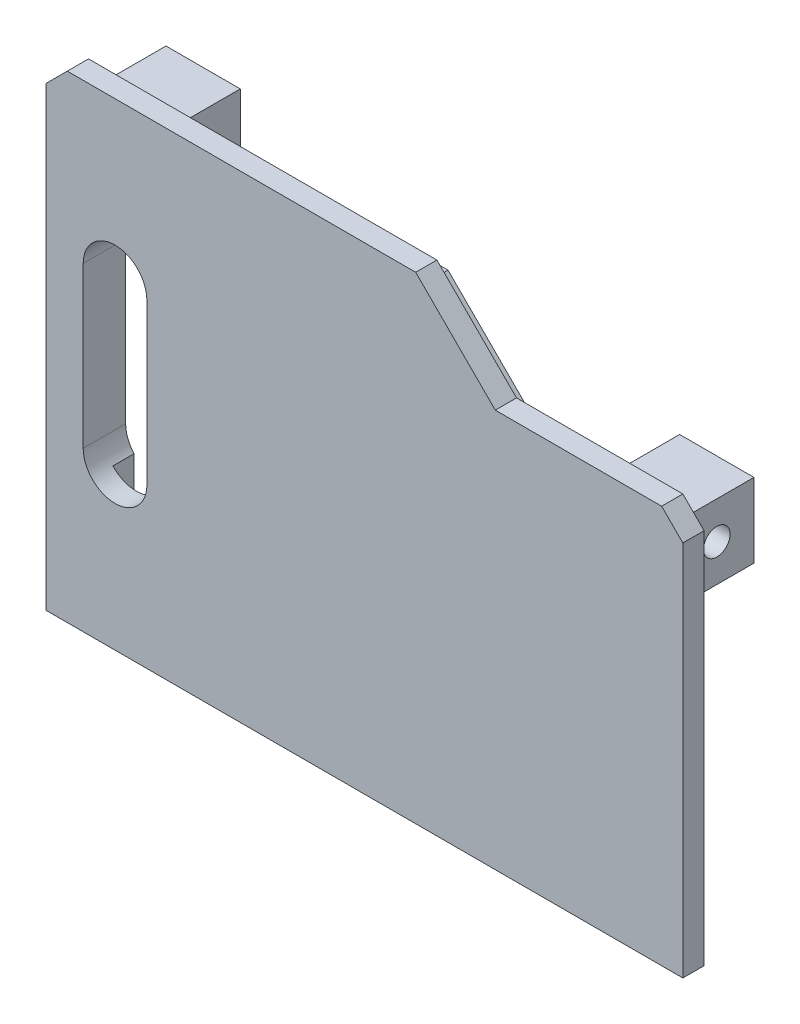
ISO-10303-21;
HEADER;
FILE_DESCRIPTION(('STEP AP214'),'2;1');
FILE_NAME('part.step','',(''),(''),'','','');
FILE_SCHEMA(('AUTOMOTIVE_DESIGN { 1 0 10303 214 1 1 1 1 }'));
ENDSEC;
DATA;
#1=APPLICATION_CONTEXT('core data for automotive mechanical design processes');
#2=APPLICATION_PROTOCOL_DEFINITION('international standard','automotive_design',2000,#1);
#3=PRODUCT_CONTEXT('',#1,'mechanical');
#4=PRODUCT('Part','Part','',(#3));
#5=PRODUCT_RELATED_PRODUCT_CATEGORY('part','',(#4));
#6=PRODUCT_DEFINITION_FORMATION('','',#4);
#7=PRODUCT_DEFINITION_CONTEXT('part definition',#1,'design');
#8=PRODUCT_DEFINITION('design','',#6,#7);
#9=PRODUCT_DEFINITION_SHAPE('','',#8);
#10=(LENGTH_UNIT() NAMED_UNIT(*) SI_UNIT(.MILLI.,.METRE.));
#11=(NAMED_UNIT(*) PLANE_ANGLE_UNIT() SI_UNIT($,.RADIAN.));
#12=(NAMED_UNIT(*) SI_UNIT($,.STERADIAN.) SOLID_ANGLE_UNIT());
#13=UNCERTAINTY_MEASURE_WITH_UNIT(LENGTH_MEASURE(1.E-05),#10,'distance_accuracy_value','');
#14=(GEOMETRIC_REPRESENTATION_CONTEXT(3) GLOBAL_UNCERTAINTY_ASSIGNED_CONTEXT((#13)) GLOBAL_UNIT_ASSIGNED_CONTEXT((#10,
#11,#12)) REPRESENTATION_CONTEXT('',''));
#15=CARTESIAN_POINT('',(0.,0.,0.));
#16=DIRECTION('',(0.,0.,1.));
#17=DIRECTION('',(1.,0.,0.));
#18=AXIS2_PLACEMENT_3D('',#15,#16,#17);
#19=CARTESIAN_POINT('',(0.,0.,-2.));
#20=DIRECTION('',(0.,0.,1.));
#21=DIRECTION('',(1.,0.,0.));
#22=AXIS2_PLACEMENT_3D('',#19,#20,#21);
#23=PLANE('',#22);
#24=CARTESIAN_POINT('',(-23.50000000001,7.55499999999001,-2.));
#25=DIRECTION('',(0.,0.,1.));
#26=DIRECTION('',(1.,0.,0.));
#27=AXIS2_PLACEMENT_3D('',#24,#25,#26);
#28=CIRCLE('',#27,3.);
#29=CARTESIAN_POINT('',(-26.50000000001,7.55499999999001,-2.));
#30=VERTEX_POINT('',#29);
#31=CARTESIAN_POINT('',(-25.7,9.59460780543792,-2.));
#32=VERTEX_POINT('',#31);
#33=EDGE_CURVE('E294',#30,#32,#28,.F.);
#34=ORIENTED_EDGE('',*,*,#33,.F.);
#35=DIRECTION('',(0.,1.,0.));
#36=VECTOR('',#35,1.);
#37=CARTESIAN_POINT('',(-26.50000000001,0.,-2.));
#38=LINE('',#37,#36);
#39=CARTESIAN_POINT('',(-26.50000000001,-7.52499999999999,-2.));
#40=VERTEX_POINT('',#39);
#41=EDGE_CURVE('E296',#40,#30,#38,.T.);
#42=ORIENTED_EDGE('',*,*,#41,.F.);
#43=CARTESIAN_POINT('',(-23.50000000001,-7.52499999999999,-2.));
#44=DIRECTION('',(0.,0.,1.));
#45=DIRECTION('',(1.,0.,0.));
#46=AXIS2_PLACEMENT_3D('',#43,#44,#45);
#47=CIRCLE('',#46,3.);
#48=CARTESIAN_POINT('',(-25.7,-9.56460780544789,-2.));
#49=VERTEX_POINT('',#48);
#50=EDGE_CURVE('E289',#49,#40,#47,.F.);
#51=ORIENTED_EDGE('',*,*,#50,.F.);
#52=DIRECTION('',(0.,1.,0.));
#53=VECTOR('',#52,1.);
#54=CARTESIAN_POINT('',(-25.7,18.2,-2.));
#55=LINE('',#54,#53);
#56=CARTESIAN_POINT('',(-25.7,-18.2,-2.));
#57=VERTEX_POINT('',#56);
#58=EDGE_CURVE('E386',#57,#49,#55,.T.);
#59=ORIENTED_EDGE('',*,*,#58,.F.);
#60=DIRECTION('',(-1.,0.,0.));
#61=VECTOR('',#60,1.);
#62=CARTESIAN_POINT('',(-25.7,-18.2,-2.));
#63=LINE('',#62,#61);
#64=CARTESIAN_POINT('',(25.7,-18.2,-2.));
#65=VERTEX_POINT('',#64);
#66=EDGE_CURVE('E382',#65,#57,#63,.T.);
#67=ORIENTED_EDGE('',*,*,#66,.F.);
#68=DIRECTION('',(0.,-1.,0.));
#69=VECTOR('',#68,1.);
#70=CARTESIAN_POINT('',(25.7,-18.2,-2.));
#71=LINE('',#70,#69);
#72=CARTESIAN_POINT('',(25.7,5.70000000000001,-2.));
#73=VERTEX_POINT('',#72);
#74=EDGE_CURVE('E380',#73,#65,#71,.T.);
#75=ORIENTED_EDGE('',*,*,#74,.F.);
#76=DIRECTION('',(1.,0.,0.));
#77=VECTOR('',#76,1.);
#78=CARTESIAN_POINT('',(0.,5.70000000000001,-2.));
#79=LINE('',#78,#77);
#80=CARTESIAN_POINT('',(27.7,5.70000000000001,-2.));
#81=VERTEX_POINT('',#80);
#82=EDGE_CURVE('E377',#73,#81,#79,.T.);
#83=ORIENTED_EDGE('',*,*,#82,.T.);
#84=DIRECTION('',(0.,-1.,0.));
#85=VECTOR('',#84,1.);
#86=CARTESIAN_POINT('',(27.7,-20.2,-2.));
#87=LINE('',#86,#85);
#88=CARTESIAN_POINT('',(27.7,-20.2,-2.));
#89=VERTEX_POINT('',#88);
#90=EDGE_CURVE('E435',#81,#89,#87,.T.);
#91=ORIENTED_EDGE('',*,*,#90,.T.);
#92=DIRECTION('',(-1.,0.,0.));
#93=VECTOR('',#92,1.);
#94=CARTESIAN_POINT('',(-27.7,-20.2,-2.));
#95=LINE('',#94,#93);
#96=CARTESIAN_POINT('',(-27.7,-20.2,-2.));
#97=VERTEX_POINT('',#96);
#98=EDGE_CURVE('E422',#89,#97,#95,.T.);
#99=ORIENTED_EDGE('',*,*,#98,.T.);
#100=DIRECTION('',(0.,1.,0.));
#101=VECTOR('',#100,1.);
#102=CARTESIAN_POINT('',(-27.7,20.2,-2.));
#103=LINE('',#102,#101);
#104=CARTESIAN_POINT('',(-27.7,13.2,-2.));
#105=VERTEX_POINT('',#104);
#106=EDGE_CURVE('E425',#97,#105,#103,.T.);
#107=ORIENTED_EDGE('',*,*,#106,.T.);
#108=DIRECTION('',(1.,0.,0.));
#109=VECTOR('',#108,1.);
#110=CARTESIAN_POINT('',(0.,13.2,-2.));
#111=LINE('',#110,#109);
#112=CARTESIAN_POINT('',(-25.7,13.2,-2.));
#113=VERTEX_POINT('',#112);
#114=EDGE_CURVE('E337',#105,#113,#111,.T.);
#115=ORIENTED_EDGE('',*,*,#114,.T.);
#116=EDGE_CURVE('E385',#32,#113,#55,.T.);
#117=ORIENTED_EDGE('',*,*,#116,.F.);
#118=EDGE_LOOP('',(#34,#42,#51,#59,#67,#75,#83,#91,#99,#107,#115,#117));
#119=FACE_BOUND('',#118,.T.);
#120=ADVANCED_FACE('F39',(#119),#23,.F.);
#121=CARTESIAN_POINT('',(0.,0.,2.));
#122=DIRECTION('',(0.,0.,1.));
#123=DIRECTION('',(1.,0.,0.));
#124=AXIS2_PLACEMENT_3D('',#121,#122,#123);
#125=PLANE('',#124);
#126=DIRECTION('',(1.,0.,0.));
#127=VECTOR('',#126,1.);
#128=CARTESIAN_POINT('',(0.,22.5,2.));
#129=LINE('',#128,#127);
#130=CARTESIAN_POINT('',(-28.,22.5,2.));
#131=VERTEX_POINT('',#130);
#132=CARTESIAN_POINT('',(4.8284271247462,22.5,2.));
#133=VERTEX_POINT('',#132);
#134=EDGE_CURVE('E468',#131,#133,#129,.T.);
#135=ORIENTED_EDGE('',*,*,#134,.F.);
#136=DIRECTION('',(0.707106781186545,0.70710678118655,0.));
#137=VECTOR('',#136,1.);
#138=CARTESIAN_POINT('',(-25.2500000000001,25.2499999999999,2.));
#139=LINE('',#138,#137);
#140=CARTESIAN_POINT('',(-30.,20.5,2.));
#141=VERTEX_POINT('',#140);
#142=EDGE_CURVE('E471',#141,#131,#139,.T.);
#143=ORIENTED_EDGE('',*,*,#142,.F.);
#144=DIRECTION('',(0.,-1.,0.));
#145=VECTOR('',#144,1.);
#146=CARTESIAN_POINT('',(-30.,0.,2.));
#147=LINE('',#146,#145);
#148=CARTESIAN_POINT('',(-30.,-22.5,2.));
#149=VERTEX_POINT('',#148);
#150=EDGE_CURVE('E475',#141,#149,#147,.T.);
#151=ORIENTED_EDGE('',*,*,#150,.T.);
#152=DIRECTION('',(1.,0.,0.));
#153=VECTOR('',#152,1.);
#154=CARTESIAN_POINT('',(0.,-22.5,2.));
#155=LINE('',#154,#153);
#156=CARTESIAN_POINT('',(30.,-22.5,2.));
#157=VERTEX_POINT('',#156);
#158=EDGE_CURVE('E477',#149,#157,#155,.T.);
#159=ORIENTED_EDGE('',*,*,#158,.T.);
#160=DIRECTION('',(0.,1.,0.));
#161=VECTOR('',#160,1.);
#162=CARTESIAN_POINT('',(30.,0.,2.));
#163=LINE('',#162,#161);
#164=CARTESIAN_POINT('',(30.,13.,2.));
#165=VERTEX_POINT('',#164);
#166=EDGE_CURVE('E479',#157,#165,#163,.T.);
#167=ORIENTED_EDGE('',*,*,#166,.T.);
#168=DIRECTION('',(0.707106781186547,-0.707106781186548,0.));
#169=VECTOR('',#168,1.);
#170=CARTESIAN_POINT('',(21.5,21.5,2.));
#171=LINE('',#170,#169);
#172=CARTESIAN_POINT('',(28.,15.,2.));
#173=VERTEX_POINT('',#172);
#174=EDGE_CURVE('E481',#173,#165,#171,.T.);
#175=ORIENTED_EDGE('',*,*,#174,.F.);
#176=DIRECTION('',(1.,0.,0.));
#177=VECTOR('',#176,1.);
#178=CARTESIAN_POINT('',(0.,15.,2.));
#179=LINE('',#178,#177);
#180=CARTESIAN_POINT('',(12.3284271247462,15.,2.));
#181=VERTEX_POINT('',#180);
#182=EDGE_CURVE('E484',#181,#173,#179,.T.);
#183=ORIENTED_EDGE('',*,*,#182,.F.);
#184=DIRECTION('',(0.707106781186548,-0.707106781186548,0.));
#185=VECTOR('',#184,1.);
#186=CARTESIAN_POINT('',(13.6642135623731,13.6642135623731,2.));
#187=LINE('',#186,#185);
#188=EDGE_CURVE('E487',#133,#181,#187,.T.);
#189=ORIENTED_EDGE('',*,*,#188,.F.);
#190=EDGE_LOOP('',(#135,#143,#151,#159,#167,#175,#183,#189));
#191=FACE_BOUND('',#190,.T.);
#192=DIRECTION('',(0.,1.,0.));
#193=VECTOR('',#192,1.);
#194=CARTESIAN_POINT('',(-26.50000000001,7.55499999999001,2.));
#195=LINE('',#194,#193);
#196=CARTESIAN_POINT('',(-26.50000000001,-7.52499999999999,2.));
#197=VERTEX_POINT('',#196);
#198=CARTESIAN_POINT('',(-26.50000000001,7.55499999999001,2.));
#199=VERTEX_POINT('',#198);
#200=EDGE_CURVE('E275',#197,#199,#195,.T.);
#201=ORIENTED_EDGE('',*,*,#200,.T.);
#202=CARTESIAN_POINT('',(-23.50000000001,7.55499999999001,2.));
#203=DIRECTION('',(0.,0.,1.));
#204=DIRECTION('',(1.,0.,0.));
#205=AXIS2_PLACEMENT_3D('',#202,#203,#204);
#206=CIRCLE('',#205,3.);
#207=CARTESIAN_POINT('',(-20.50000000001,7.55499999999001,2.));
#208=VERTEX_POINT('',#207);
#209=EDGE_CURVE('E54',#199,#208,#206,.F.);
#210=ORIENTED_EDGE('',*,*,#209,.T.);
#211=DIRECTION('',(0.,-1.,0.));
#212=VECTOR('',#211,1.);
#213=CARTESIAN_POINT('',(-20.50000000001,7.55499999999001,2.));
#214=LINE('',#213,#212);
#215=CARTESIAN_POINT('',(-20.50000000001,-7.52499999999999,2.00000000000001));
#216=VERTEX_POINT('',#215);
#217=EDGE_CURVE('E262',#208,#216,#214,.T.);
#218=ORIENTED_EDGE('',*,*,#217,.T.);
#219=CARTESIAN_POINT('',(-23.50000000001,-7.52499999999999,2.));
#220=DIRECTION('',(0.,0.,1.));
#221=DIRECTION('',(1.,0.,0.));
#222=AXIS2_PLACEMENT_3D('',#219,#220,#221);
#223=CIRCLE('',#222,3.);
#224=EDGE_CURVE('E269',#216,#197,#223,.F.);
#225=ORIENTED_EDGE('',*,*,#224,.T.);
#226=EDGE_LOOP('',(#201,#210,#218,#225));
#227=FACE_BOUND('',#226,.T.);
#228=ADVANCED_FACE('F277',(#191,#227),#125,.T.);
#229=CARTESIAN_POINT('',(-25.7,18.2,-2.));
#230=DIRECTION('',(1.,0.,0.));
#231=DIRECTION('',(0.,1.,0.));
#232=AXIS2_PLACEMENT_3D('',#229,#230,#231);
#233=PLANE('',#232);
#234=DIRECTION('',(0.,1.,0.));
#235=VECTOR('',#234,1.);
#236=CARTESIAN_POINT('',(-25.7,18.2,0.));
#237=LINE('',#236,#235);
#238=CARTESIAN_POINT('',(-25.7,9.59460780543792,0.));
#239=VERTEX_POINT('',#238);
#240=CARTESIAN_POINT('',(-25.7,13.2,0.));
#241=VERTEX_POINT('',#240);
#242=EDGE_CURVE('E402',#239,#241,#237,.T.);
#243=ORIENTED_EDGE('',*,*,#242,.F.);
#244=DIRECTION('',(0.,0.,1.));
#245=VECTOR('',#244,1.);
#246=CARTESIAN_POINT('',(-25.7,9.59460780543792,-7.));
#247=LINE('',#246,#245);
#248=EDGE_CURVE('E291',#239,#32,#247,.F.);
#249=ORIENTED_EDGE('',*,*,#248,.T.);
#250=ORIENTED_EDGE('',*,*,#116,.T.);
#251=DIRECTION('',(0.,0.,-1.));
#252=VECTOR('',#251,1.);
#253=CARTESIAN_POINT('',(-25.7,13.2,-2.));
#254=LINE('',#253,#252);
#255=EDGE_CURVE('E334',#241,#113,#254,.T.);
#256=ORIENTED_EDGE('',*,*,#255,.F.);
#257=EDGE_LOOP('',(#243,#249,#250,#256));
#258=FACE_BOUND('',#257,.T.);
#259=ADVANCED_FACE('F581',(#258),#233,.T.);
#260=ORIENTED_EDGE('',*,*,#58,.T.);
#261=DIRECTION('',(0.,0.,1.));
#262=VECTOR('',#261,1.);
#263=CARTESIAN_POINT('',(-25.7,-9.56460780544789,-7.));
#264=LINE('',#263,#262);
#265=CARTESIAN_POINT('',(-25.7,-9.56460780544789,0.));
#266=VERTEX_POINT('',#265);
#267=EDGE_CURVE('E286',#49,#266,#264,.T.);
#268=ORIENTED_EDGE('',*,*,#267,.T.);
#269=CARTESIAN_POINT('',(-25.7,-18.2,0.));
#270=VERTEX_POINT('',#269);
#271=EDGE_CURVE('E403',#270,#266,#237,.T.);
#272=ORIENTED_EDGE('',*,*,#271,.F.);
#273=DIRECTION('',(0.,0.,1.));
#274=VECTOR('',#273,1.);
#275=CARTESIAN_POINT('',(-25.7,-18.2,-2.));
#276=LINE('',#275,#274);
#277=EDGE_CURVE('E416',#57,#270,#276,.T.);
#278=ORIENTED_EDGE('',*,*,#277,.F.);
#279=EDGE_LOOP('',(#260,#268,#272,#278));
#280=FACE_BOUND('',#279,.T.);
#281=ADVANCED_FACE('F536',(#280),#233,.T.);
#282=CARTESIAN_POINT('',(25.7,10.7,-2.));
#283=DIRECTION('',(0.,-1.,0.));
#284=DIRECTION('',(1.,0.,0.));
#285=AXIS2_PLACEMENT_3D('',#282,#283,#284);
#286=PLANE('',#285);
#287=DIRECTION('',(1.,0.,0.));
#288=VECTOR('',#287,1.);
#289=CARTESIAN_POINT('',(25.7,10.7,-2.));
#290=LINE('',#289,#288);
#291=CARTESIAN_POINT('',(10.5473088065419,10.7,-2.));
#292=VERTEX_POINT('',#291);
#293=CARTESIAN_POINT('',(20.7,10.7,-2.));
#294=VERTEX_POINT('',#293);
#295=EDGE_CURVE('E394',#292,#294,#290,.T.);
#296=ORIENTED_EDGE('',*,*,#295,.T.);
#297=DIRECTION('',(0.,0.,1.));
#298=VECTOR('',#297,1.);
#299=CARTESIAN_POINT('',(20.7,10.7,-2.));
#300=LINE('',#299,#298);
#301=CARTESIAN_POINT('',(20.7,10.7,0.));
#302=VERTEX_POINT('',#301);
#303=EDGE_CURVE('E364',#294,#302,#300,.T.);
#304=ORIENTED_EDGE('',*,*,#303,.T.);
#305=DIRECTION('',(1.,0.,0.));
#306=VECTOR('',#305,1.);
#307=CARTESIAN_POINT('',(25.7,10.7,0.));
#308=LINE('',#307,#306);
#309=CARTESIAN_POINT('',(10.5473088065419,10.7,0.));
#310=VERTEX_POINT('',#309);
#311=EDGE_CURVE('E383',#310,#302,#308,.T.);
#312=ORIENTED_EDGE('',*,*,#311,.F.);
#313=DIRECTION('',(0.,0.,1.));
#314=VECTOR('',#313,1.);
#315=CARTESIAN_POINT('',(10.5473088065419,10.7,-2.));
#316=LINE('',#315,#314);
#317=EDGE_CURVE('E397',#292,#310,#316,.T.);
#318=ORIENTED_EDGE('',*,*,#317,.F.);
#319=EDGE_LOOP('',(#296,#304,#312,#318));
#320=FACE_BOUND('',#319,.T.);
#321=ADVANCED_FACE('F601',(#320),#286,.T.);
#322=CARTESIAN_POINT('',(0.,0.,0.));
#323=DIRECTION('',(0.,0.,1.));
#324=DIRECTION('',(1.,0.,0.));
#325=AXIS2_PLACEMENT_3D('',#322,#323,#324);
#326=PLANE('',#325);
#327=DIRECTION('',(1.,0.,0.));
#328=VECTOR('',#327,1.);
#329=CARTESIAN_POINT('',(0.,22.5,0.));
#330=LINE('',#329,#328);
#331=CARTESIAN_POINT('',(-28.,22.5,0.));
#332=VERTEX_POINT('',#331);
#333=CARTESIAN_POINT('',(4.8284271247462,22.5,0.));
#334=VERTEX_POINT('',#333);
#335=EDGE_CURVE('E467',#332,#334,#330,.T.);
#336=ORIENTED_EDGE('',*,*,#335,.T.);
#337=DIRECTION('',(0.707106781186548,-0.707106781186548,0.));
#338=VECTOR('',#337,1.);
#339=CARTESIAN_POINT('',(13.6642135623731,13.6642135623731,0.));
#340=LINE('',#339,#338);
#341=CARTESIAN_POINT('',(12.3284271247462,15.,0.));
#342=VERTEX_POINT('',#341);
#343=EDGE_CURVE('E472',#334,#342,#340,.T.);
#344=ORIENTED_EDGE('',*,*,#343,.T.);
#345=DIRECTION('',(1.,0.,0.));
#346=VECTOR('',#345,1.);
#347=CARTESIAN_POINT('',(0.,15.,0.));
#348=LINE('',#347,#346);
#349=CARTESIAN_POINT('',(28.,15.,0.));
#350=VERTEX_POINT('',#349);
#351=EDGE_CURVE('E506',#342,#350,#348,.T.);
#352=ORIENTED_EDGE('',*,*,#351,.T.);
#353=DIRECTION('',(0.707106781186547,-0.707106781186548,0.));
#354=VECTOR('',#353,1.);
#355=CARTESIAN_POINT('',(21.5,21.5,0.));
#356=LINE('',#355,#354);
#357=CARTESIAN_POINT('',(30.,13.,0.));
#358=VERTEX_POINT('',#357);
#359=EDGE_CURVE('E503',#350,#358,#356,.T.);
#360=ORIENTED_EDGE('',*,*,#359,.T.);
#361=DIRECTION('',(0.,1.,0.));
#362=VECTOR('',#361,1.);
#363=CARTESIAN_POINT('',(30.,0.,0.));
#364=LINE('',#363,#362);
#365=CARTESIAN_POINT('',(30.,-22.5,0.));
#366=VERTEX_POINT('',#365);
#367=EDGE_CURVE('E500',#366,#358,#364,.T.);
#368=ORIENTED_EDGE('',*,*,#367,.F.);
#369=DIRECTION('',(1.,0.,0.));
#370=VECTOR('',#369,1.);
#371=CARTESIAN_POINT('',(0.,-22.5,0.));
#372=LINE('',#371,#370);
#373=CARTESIAN_POINT('',(-30.,-22.5,0.));
#374=VERTEX_POINT('',#373);
#375=EDGE_CURVE('E498',#374,#366,#372,.T.);
#376=ORIENTED_EDGE('',*,*,#375,.F.);
#377=DIRECTION('',(0.,-1.,0.));
#378=VECTOR('',#377,1.);
#379=CARTESIAN_POINT('',(-30.,0.,0.));
#380=LINE('',#379,#378);
#381=CARTESIAN_POINT('',(-30.,20.5,0.));
#382=VERTEX_POINT('',#381);
#383=EDGE_CURVE('E496',#382,#374,#380,.T.);
#384=ORIENTED_EDGE('',*,*,#383,.F.);
#385=DIRECTION('',(0.707106781186545,0.70710678118655,0.));
#386=VECTOR('',#385,1.);
#387=CARTESIAN_POINT('',(-25.2500000000001,25.2499999999999,0.));
#388=LINE('',#387,#386);
#389=EDGE_CURVE('E493',#382,#332,#388,.T.);
#390=ORIENTED_EDGE('',*,*,#389,.T.);
#391=EDGE_LOOP('',(#336,#344,#352,#360,#368,#376,#384,#390));
#392=FACE_BOUND('',#391,.T.);
#393=DIRECTION('',(-1.,0.,0.));
#394=VECTOR('',#393,1.);
#395=CARTESIAN_POINT('',(-27.7,-20.2,0.));
#396=LINE('',#395,#394);
#397=CARTESIAN_POINT('',(27.7,-20.2,0.));
#398=VERTEX_POINT('',#397);
#399=CARTESIAN_POINT('',(-27.7,-20.2,0.));
#400=VERTEX_POINT('',#399);
#401=EDGE_CURVE('E421',#398,#400,#396,.T.);
#402=ORIENTED_EDGE('',*,*,#401,.F.);
#403=DIRECTION('',(0.,-1.,0.));
#404=VECTOR('',#403,1.);
#405=CARTESIAN_POINT('',(27.7,-20.2,0.));
#406=LINE('',#405,#404);
#407=CARTESIAN_POINT('',(27.7,12.7,0.));
#408=VERTEX_POINT('',#407);
#409=EDGE_CURVE('E426',#408,#398,#406,.T.);
#410=ORIENTED_EDGE('',*,*,#409,.F.);
#411=DIRECTION('',(1.,0.,0.));
#412=VECTOR('',#411,1.);
#413=CARTESIAN_POINT('',(27.7,12.7,0.));
#414=LINE('',#413,#412);
#415=CARTESIAN_POINT('',(11.3757359312881,12.7,0.));
#416=VERTEX_POINT('',#415);
#417=EDGE_CURVE('E447',#416,#408,#414,.T.);
#418=ORIENTED_EDGE('',*,*,#417,.F.);
#419=DIRECTION('',(0.707106781186548,-0.707106781186547,0.));
#420=VECTOR('',#419,1.);
#421=CARTESIAN_POINT('',(11.3757359312881,12.7,0.));
#422=LINE('',#421,#420);
#423=CARTESIAN_POINT('',(3.87573593128807,20.2,0.));
#424=VERTEX_POINT('',#423);
#425=EDGE_CURVE('E444',#424,#416,#422,.T.);
#426=ORIENTED_EDGE('',*,*,#425,.F.);
#427=DIRECTION('',(1.,0.,0.));
#428=VECTOR('',#427,1.);
#429=CARTESIAN_POINT('',(3.87573593128807,20.2,0.));
#430=LINE('',#429,#428);
#431=CARTESIAN_POINT('',(-27.7,20.2,0.));
#432=VERTEX_POINT('',#431);
#433=EDGE_CURVE('E442',#432,#424,#430,.T.);
#434=ORIENTED_EDGE('',*,*,#433,.F.);
#435=DIRECTION('',(0.,1.,0.));
#436=VECTOR('',#435,1.);
#437=CARTESIAN_POINT('',(-27.7,20.2,0.));
#438=LINE('',#437,#436);
#439=EDGE_CURVE('E440',#400,#432,#438,.T.);
#440=ORIENTED_EDGE('',*,*,#439,.F.);
#441=EDGE_LOOP('',(#402,#410,#418,#426,#434,#440));
#442=FACE_BOUND('',#441,.T.);
#443=ADVANCED_FACE('F615',(#392,#442),#326,.F.);
#444=CARTESIAN_POINT('',(0.,22.5,2.));
#445=DIRECTION('',(0.,1.,0.));
#446=DIRECTION('',(0.,0.,1.));
#447=AXIS2_PLACEMENT_3D('',#444,#445,#446);
#448=PLANE('',#447);
#449=ORIENTED_EDGE('',*,*,#335,.F.);
#450=DIRECTION('',(0.,0.,-1.));
#451=VECTOR('',#450,1.);
#452=CARTESIAN_POINT('',(-28.,22.5,2.));
#453=LINE('',#452,#451);
#454=EDGE_CURVE('E526',#131,#332,#453,.T.);
#455=ORIENTED_EDGE('',*,*,#454,.F.);
#456=ORIENTED_EDGE('',*,*,#134,.T.);
#457=DIRECTION('',(0.,0.,-1.));
#458=VECTOR('',#457,1.);
#459=CARTESIAN_POINT('',(4.8284271247462,22.5,2.));
#460=LINE('',#459,#458);
#461=EDGE_CURVE('E490',#133,#334,#460,.T.);
#462=ORIENTED_EDGE('',*,*,#461,.T.);
#463=EDGE_LOOP('',(#449,#455,#456,#462));
#464=FACE_BOUND('',#463,.T.);
#465=ADVANCED_FACE('F41',(#464),#448,.T.);
#466=CARTESIAN_POINT('',(-25.2500000000001,25.2499999999999,2.));
#467=DIRECTION('',(-0.70710678118655,0.707106781186545,0.));
#468=DIRECTION('',(-0.707106781186545,-0.70710678118655,0.));
#469=AXIS2_PLACEMENT_3D('',#466,#467,#468);
#470=PLANE('',#469);
#471=ORIENTED_EDGE('',*,*,#389,.F.);
#472=DIRECTION('',(0.,0.,-1.));
#473=VECTOR('',#472,1.);
#474=CARTESIAN_POINT('',(-30.,20.5,2.));
#475=LINE('',#474,#473);
#476=EDGE_CURVE('E524',#141,#382,#475,.T.);
#477=ORIENTED_EDGE('',*,*,#476,.F.);
#478=ORIENTED_EDGE('',*,*,#142,.T.);
#479=ORIENTED_EDGE('',*,*,#454,.T.);
#480=EDGE_LOOP('',(#471,#477,#478,#479));
#481=FACE_BOUND('',#480,.T.);
#482=ADVANCED_FACE('F693',(#481),#470,.T.);
#483=CARTESIAN_POINT('',(-30.,0.,2.));
#484=DIRECTION('',(1.,0.,0.));
#485=DIRECTION('',(0.,1.,0.));
#486=AXIS2_PLACEMENT_3D('',#483,#484,#485);
#487=PLANE('',#486);
#488=ORIENTED_EDGE('',*,*,#383,.T.);
#489=DIRECTION('',(0.,0.,-1.));
#490=VECTOR('',#489,1.);
#491=CARTESIAN_POINT('',(-30.,-22.5,2.));
#492=LINE('',#491,#490);
#493=EDGE_CURVE('E521',#149,#374,#492,.T.);
#494=ORIENTED_EDGE('',*,*,#493,.F.);
#495=ORIENTED_EDGE('',*,*,#150,.F.);
#496=ORIENTED_EDGE('',*,*,#476,.T.);
#497=EDGE_LOOP('',(#488,#494,#495,#496));
#498=FACE_BOUND('',#497,.T.);
#499=ADVANCED_FACE('F690',(#498),#487,.F.);
#500=CARTESIAN_POINT('',(0.,-22.5,2.));
#501=DIRECTION('',(0.,1.,0.));
#502=DIRECTION('',(0.,0.,1.));
#503=AXIS2_PLACEMENT_3D('',#500,#501,#502);
#504=PLANE('',#503);
#505=ORIENTED_EDGE('',*,*,#375,.T.);
#506=DIRECTION('',(0.,0.,-1.));
#507=VECTOR('',#506,1.);
#508=CARTESIAN_POINT('',(30.,-22.5,2.));
#509=LINE('',#508,#507);
#510=EDGE_CURVE('E518',#157,#366,#509,.T.);
#511=ORIENTED_EDGE('',*,*,#510,.F.);
#512=ORIENTED_EDGE('',*,*,#158,.F.);
#513=ORIENTED_EDGE('',*,*,#493,.T.);
#514=EDGE_LOOP('',(#505,#511,#512,#513));
#515=FACE_BOUND('',#514,.T.);
#516=ADVANCED_FACE('F686',(#515),#504,.F.);
#517=CARTESIAN_POINT('',(30.,0.,2.));
#518=DIRECTION('',(-1.,0.,0.));
#519=DIRECTION('',(0.,-1.,0.));
#520=AXIS2_PLACEMENT_3D('',#517,#518,#519);
#521=PLANE('',#520);
#522=ORIENTED_EDGE('',*,*,#367,.T.);
#523=DIRECTION('',(0.,0.,-1.));
#524=VECTOR('',#523,1.);
#525=CARTESIAN_POINT('',(30.,13.,2.));
#526=LINE('',#525,#524);
#527=EDGE_CURVE('E516',#165,#358,#526,.T.);
#528=ORIENTED_EDGE('',*,*,#527,.F.);
#529=ORIENTED_EDGE('',*,*,#166,.F.);
#530=ORIENTED_EDGE('',*,*,#510,.T.);
#531=EDGE_LOOP('',(#522,#528,#529,#530));
#532=FACE_BOUND('',#531,.T.);
#533=ADVANCED_FACE('F682',(#532),#521,.F.);
#534=CARTESIAN_POINT('',(21.5,21.5,2.));
#535=DIRECTION('',(0.707106781186548,0.707106781186547,0.));
#536=DIRECTION('',(-0.707106781186547,0.707106781186548,0.));
#537=AXIS2_PLACEMENT_3D('',#534,#535,#536);
#538=PLANE('',#537);
#539=ORIENTED_EDGE('',*,*,#359,.F.);
#540=DIRECTION('',(0.,0.,-1.));
#541=VECTOR('',#540,1.);
#542=CARTESIAN_POINT('',(28.,15.,2.));
#543=LINE('',#542,#541);
#544=EDGE_CURVE('E514',#173,#350,#543,.T.);
#545=ORIENTED_EDGE('',*,*,#544,.F.);
#546=ORIENTED_EDGE('',*,*,#174,.T.);
#547=ORIENTED_EDGE('',*,*,#527,.T.);
#548=EDGE_LOOP('',(#539,#545,#546,#547));
#549=FACE_BOUND('',#548,.T.);
#550=ADVANCED_FACE('F678',(#549),#538,.T.);
#551=CARTESIAN_POINT('',(0.,15.,2.));
#552=DIRECTION('',(0.,1.,0.));
#553=DIRECTION('',(-1.,0.,0.));
#554=AXIS2_PLACEMENT_3D('',#551,#552,#553);
#555=PLANE('',#554);
#556=ORIENTED_EDGE('',*,*,#351,.F.);
#557=DIRECTION('',(0.,0.,-1.));
#558=VECTOR('',#557,1.);
#559=CARTESIAN_POINT('',(12.3284271247462,15.,2.));
#560=LINE('',#559,#558);
#561=EDGE_CURVE('E512',#181,#342,#560,.T.);
#562=ORIENTED_EDGE('',*,*,#561,.F.);
#563=ORIENTED_EDGE('',*,*,#182,.T.);
#564=ORIENTED_EDGE('',*,*,#544,.T.);
#565=EDGE_LOOP('',(#556,#562,#563,#564));
#566=FACE_BOUND('',#565,.T.);
#567=ADVANCED_FACE('F656',(#566),#555,.T.);
#568=CARTESIAN_POINT('',(13.6642135623731,13.6642135623731,2.));
#569=DIRECTION('',(0.707106781186547,0.707106781186547,0.));
#570=DIRECTION('',(-0.707106781186548,0.707106781186548,0.));
#571=AXIS2_PLACEMENT_3D('',#568,#569,#570);
#572=PLANE('',#571);
#573=ORIENTED_EDGE('',*,*,#343,.F.);
#574=ORIENTED_EDGE('',*,*,#461,.F.);
#575=ORIENTED_EDGE('',*,*,#188,.T.);
#576=ORIENTED_EDGE('',*,*,#561,.T.);
#577=EDGE_LOOP('',(#573,#574,#575,#576));
#578=FACE_BOUND('',#577,.T.);
#579=ADVANCED_FACE('F649',(#578),#572,.T.);
#580=DIRECTION('',(1.,0.,0.));
#581=VECTOR('',#580,1.);
#582=CARTESIAN_POINT('',(3.04730880654188,18.2,-2.));
#583=LINE('',#582,#581);
#584=CARTESIAN_POINT('',(-20.7,18.2,-2.));
#585=VERTEX_POINT('',#584);
#586=CARTESIAN_POINT('',(3.04730880654188,18.2,-2.));
#587=VERTEX_POINT('',#586);
#588=EDGE_CURVE('E389',#585,#587,#583,.T.);
#589=ORIENTED_EDGE('',*,*,#588,.F.);
#590=DIRECTION('',(0.,1.,0.));
#591=VECTOR('',#590,1.);
#592=CARTESIAN_POINT('',(-20.7,0.,-2.));
#593=LINE('',#592,#591);
#594=CARTESIAN_POINT('',(-20.7,20.2,-2.));
#595=VERTEX_POINT('',#594);
#596=EDGE_CURVE('E331',#585,#595,#593,.T.);
#597=ORIENTED_EDGE('',*,*,#596,.T.);
#598=DIRECTION('',(1.,0.,0.));
#599=VECTOR('',#598,1.);
#600=CARTESIAN_POINT('',(3.87573593128807,20.2,-2.));
#601=LINE('',#600,#599);
#602=CARTESIAN_POINT('',(3.87573593128807,20.2,-2.));
#603=VERTEX_POINT('',#602);
#604=EDGE_CURVE('E429',#595,#603,#601,.T.);
#605=ORIENTED_EDGE('',*,*,#604,.T.);
#606=DIRECTION('',(0.707106781186548,-0.707106781186547,0.));
#607=VECTOR('',#606,1.);
#608=CARTESIAN_POINT('',(11.3757359312881,12.7,-2.));
#609=LINE('',#608,#607);
#610=CARTESIAN_POINT('',(11.3757359312881,12.7,-2.));
#611=VERTEX_POINT('',#610);
#612=EDGE_CURVE('E431',#603,#611,#609,.T.);
#613=ORIENTED_EDGE('',*,*,#612,.T.);
#614=DIRECTION('',(1.,0.,0.));
#615=VECTOR('',#614,1.);
#616=CARTESIAN_POINT('',(27.7,12.7,-2.));
#617=LINE('',#616,#615);
#618=CARTESIAN_POINT('',(20.7,12.7,-2.));
#619=VERTEX_POINT('',#618);
#620=EDGE_CURVE('E433',#611,#619,#617,.T.);
#621=ORIENTED_EDGE('',*,*,#620,.T.);
#622=DIRECTION('',(0.,1.,0.));
#623=VECTOR('',#622,1.);
#624=CARTESIAN_POINT('',(20.7,0.,-2.));
#625=LINE('',#624,#623);
#626=EDGE_CURVE('E371',#294,#619,#625,.T.);
#627=ORIENTED_EDGE('',*,*,#626,.F.);
#628=ORIENTED_EDGE('',*,*,#295,.F.);
#629=DIRECTION('',(0.707106781186548,-0.707106781186547,0.));
#630=VECTOR('',#629,1.);
#631=CARTESIAN_POINT('',(10.5473088065419,10.7,-2.));
#632=LINE('',#631,#630);
#633=EDGE_CURVE('E391',#587,#292,#632,.T.);
#634=ORIENTED_EDGE('',*,*,#633,.F.);
#635=EDGE_LOOP('',(#589,#597,#605,#613,#621,#627,#628,#634));
#636=FACE_BOUND('',#635,.T.);
#637=ADVANCED_FACE('F640',(#636),#23,.F.);
#638=CARTESIAN_POINT('',(-27.7,-20.2,-2.));
#639=DIRECTION('',(0.,1.,0.));
#640=DIRECTION('',(0.,0.,1.));
#641=AXIS2_PLACEMENT_3D('',#638,#639,#640);
#642=PLANE('',#641);
#643=ORIENTED_EDGE('',*,*,#401,.T.);
#644=DIRECTION('',(0.,0.,1.));
#645=VECTOR('',#644,1.);
#646=CARTESIAN_POINT('',(-27.7,-20.2,-2.));
#647=LINE('',#646,#645);
#648=EDGE_CURVE('E464',#97,#400,#647,.T.);
#649=ORIENTED_EDGE('',*,*,#648,.F.);
#650=ORIENTED_EDGE('',*,*,#98,.F.);
#651=DIRECTION('',(0.,0.,1.));
#652=VECTOR('',#651,1.);
#653=CARTESIAN_POINT('',(27.7,-20.2,-2.));
#654=LINE('',#653,#652);
#655=EDGE_CURVE('E437',#89,#398,#654,.T.);
#656=ORIENTED_EDGE('',*,*,#655,.T.);
#657=EDGE_LOOP('',(#643,#649,#650,#656));
#658=FACE_BOUND('',#657,.T.);
#659=ADVANCED_FACE('F566',(#658),#642,.F.);
#660=CARTESIAN_POINT('',(-27.7,20.2,-2.));
#661=DIRECTION('',(1.,0.,0.));
#662=DIRECTION('',(0.,0.,-1.));
#663=AXIS2_PLACEMENT_3D('',#660,#661,#662);
#664=PLANE('',#663);
#665=ORIENTED_EDGE('',*,*,#439,.T.);
#666=DIRECTION('',(0.,0.,1.));
#667=VECTOR('',#666,1.);
#668=CARTESIAN_POINT('',(-27.7,20.2,-2.));
#669=LINE('',#668,#667);
#670=CARTESIAN_POINT('',(-27.7,20.2,-7.));
#671=VERTEX_POINT('',#670);
#672=EDGE_CURVE('E461',#671,#432,#669,.T.);
#673=ORIENTED_EDGE('',*,*,#672,.F.);
#674=DIRECTION('',(0.,-1.,0.));
#675=VECTOR('',#674,1.);
#676=CARTESIAN_POINT('',(-27.7,20.2,-7.));
#677=LINE('',#676,#675);
#678=CARTESIAN_POINT('',(-27.7,13.2,-7.));
#679=VERTEX_POINT('',#678);
#680=EDGE_CURVE('E302',#671,#679,#677,.T.);
#681=ORIENTED_EDGE('',*,*,#680,.T.);
#682=DIRECTION('',(0.,0.,1.));
#683=VECTOR('',#682,1.);
#684=CARTESIAN_POINT('',(-27.7,13.2,0.));
#685=LINE('',#684,#683);
#686=EDGE_CURVE('E309',#679,#105,#685,.T.);
#687=ORIENTED_EDGE('',*,*,#686,.T.);
#688=ORIENTED_EDGE('',*,*,#106,.F.);
#689=ORIENTED_EDGE('',*,*,#648,.T.);
#690=EDGE_LOOP('',(#665,#673,#681,#687,#688,#689));
#691=FACE_BOUND('',#690,.T.);
#692=CARTESIAN_POINT('',(-27.7,16.7,-3.5));
#693=DIRECTION('',(-1.,0.,0.));
#694=DIRECTION('',(0.,0.,1.));
#695=AXIS2_PLACEMENT_3D('',#692,#693,#694);
#696=CIRCLE('',#695,1.25);
#697=CARTESIAN_POINT('',(-27.7,16.7,-2.25));
#698=VERTEX_POINT('',#697);
#699=EDGE_CURVE('E298',#698,#698,#696,.T.);
#700=ORIENTED_EDGE('',*,*,#699,.F.);
#701=EDGE_LOOP('',(#700));
#702=FACE_BOUND('',#701,.T.);
#703=ADVANCED_FACE('F569',(#691,#702),#664,.F.);
#704=CARTESIAN_POINT('',(3.87573593128807,20.2,-2.));
#705=DIRECTION('',(0.,-1.,0.));
#706=DIRECTION('',(0.,0.,-1.));
#707=AXIS2_PLACEMENT_3D('',#704,#705,#706);
#708=PLANE('',#707);
#709=ORIENTED_EDGE('',*,*,#604,.F.);
#710=DIRECTION('',(0.,0.,-1.));
#711=VECTOR('',#710,1.);
#712=CARTESIAN_POINT('',(-20.7,20.2,0.));
#713=LINE('',#712,#711);
#714=CARTESIAN_POINT('',(-20.7,20.2,-7.));
#715=VERTEX_POINT('',#714);
#716=EDGE_CURVE('E308',#595,#715,#713,.T.);
#717=ORIENTED_EDGE('',*,*,#716,.T.);
#718=DIRECTION('',(-1.,0.,0.));
#719=VECTOR('',#718,1.);
#720=CARTESIAN_POINT('',(-20.7,20.2,-7.));
#721=LINE('',#720,#719);
#722=EDGE_CURVE('E317',#715,#671,#721,.T.);
#723=ORIENTED_EDGE('',*,*,#722,.T.);
#724=ORIENTED_EDGE('',*,*,#672,.T.);
#725=ORIENTED_EDGE('',*,*,#433,.T.);
#726=DIRECTION('',(0.,0.,1.));
#727=VECTOR('',#726,1.);
#728=CARTESIAN_POINT('',(3.87573593128807,20.2,-2.));
#729=LINE('',#728,#727);
#730=EDGE_CURVE('E458',#603,#424,#729,.T.);
#731=ORIENTED_EDGE('',*,*,#730,.F.);
#732=EDGE_LOOP('',(#709,#717,#723,#724,#725,#731));
#733=FACE_BOUND('',#732,.T.);
#734=ADVANCED_FACE('F620',(#733),#708,.F.);
#735=CARTESIAN_POINT('',(11.3757359312881,12.7,-2.));
#736=DIRECTION('',(-0.707106781186547,-0.707106781186548,0.));
#737=DIRECTION('',(0.707106781186548,-0.707106781186547,0.));
#738=AXIS2_PLACEMENT_3D('',#735,#736,#737);
#739=PLANE('',#738);
#740=ORIENTED_EDGE('',*,*,#425,.T.);
#741=DIRECTION('',(0.,0.,1.));
#742=VECTOR('',#741,1.);
#743=CARTESIAN_POINT('',(11.3757359312881,12.7,-2.));
#744=LINE('',#743,#742);
#745=EDGE_CURVE('E455',#611,#416,#744,.T.);
#746=ORIENTED_EDGE('',*,*,#745,.F.);
#747=ORIENTED_EDGE('',*,*,#612,.F.);
#748=ORIENTED_EDGE('',*,*,#730,.T.);
#749=EDGE_LOOP('',(#740,#746,#747,#748));
#750=FACE_BOUND('',#749,.T.);
#751=ADVANCED_FACE('F662',(#750),#739,.F.);
#752=CARTESIAN_POINT('',(27.7,12.7,-2.));
#753=DIRECTION('',(0.,-1.,0.));
#754=DIRECTION('',(0.,0.,-1.));
#755=AXIS2_PLACEMENT_3D('',#752,#753,#754);
#756=PLANE('',#755);
#757=DIRECTION('',(0.,0.,1.));
#758=VECTOR('',#757,1.);
#759=CARTESIAN_POINT('',(27.7,12.7,-2.));
#760=LINE('',#759,#758);
#761=CARTESIAN_POINT('',(27.7,12.7,-7.));
#762=VERTEX_POINT('',#761);
#763=EDGE_CURVE('E452',#762,#408,#760,.T.);
#764=ORIENTED_EDGE('',*,*,#763,.F.);
#765=DIRECTION('',(1.,0.,0.));
#766=VECTOR('',#765,1.);
#767=CARTESIAN_POINT('',(20.7,12.7,-7.));
#768=LINE('',#767,#766);
#769=CARTESIAN_POINT('',(20.7,12.7,-7.));
#770=VERTEX_POINT('',#769);
#771=EDGE_CURVE('E361',#770,#762,#768,.T.);
#772=ORIENTED_EDGE('',*,*,#771,.F.);
#773=DIRECTION('',(0.,0.,1.));
#774=VECTOR('',#773,1.);
#775=CARTESIAN_POINT('',(20.7,12.7,0.));
#776=LINE('',#775,#774);
#777=EDGE_CURVE('E354',#770,#619,#776,.T.);
#778=ORIENTED_EDGE('',*,*,#777,.T.);
#779=ORIENTED_EDGE('',*,*,#620,.F.);
#780=ORIENTED_EDGE('',*,*,#745,.T.);
#781=ORIENTED_EDGE('',*,*,#417,.T.);
#782=EDGE_LOOP('',(#764,#772,#778,#779,#780,#781));
#783=FACE_BOUND('',#782,.T.);
#784=ADVANCED_FACE('F611',(#783),#756,.F.);
#785=CARTESIAN_POINT('',(27.7,-20.2,-2.));
#786=DIRECTION('',(-1.,0.,0.));
#787=DIRECTION('',(0.,0.,1.));
#788=AXIS2_PLACEMENT_3D('',#785,#786,#787);
#789=PLANE('',#788);
#790=ORIENTED_EDGE('',*,*,#90,.F.);
#791=DIRECTION('',(0.,0.,-1.));
#792=VECTOR('',#791,1.);
#793=CARTESIAN_POINT('',(27.7,5.70000000000001,0.));
#794=LINE('',#793,#792);
#795=CARTESIAN_POINT('',(27.7,5.70000000000001,-7.));
#796=VERTEX_POINT('',#795);
#797=EDGE_CURVE('E344',#81,#796,#794,.T.);
#798=ORIENTED_EDGE('',*,*,#797,.T.);
#799=DIRECTION('',(0.,1.,0.));
#800=VECTOR('',#799,1.);
#801=CARTESIAN_POINT('',(27.7,12.7,-7.));
#802=LINE('',#801,#800);
#803=EDGE_CURVE('E351',#796,#762,#802,.T.);
#804=ORIENTED_EDGE('',*,*,#803,.T.);
#805=ORIENTED_EDGE('',*,*,#763,.T.);
#806=ORIENTED_EDGE('',*,*,#409,.T.);
#807=ORIENTED_EDGE('',*,*,#655,.F.);
#808=EDGE_LOOP('',(#790,#798,#804,#805,#806,#807));
#809=FACE_BOUND('',#808,.T.);
#810=CARTESIAN_POINT('',(27.7,9.20000000000001,-3.5));
#811=DIRECTION('',(1.,0.,0.));
#812=DIRECTION('',(0.,0.,-1.));
#813=AXIS2_PLACEMENT_3D('',#810,#811,#812);
#814=CIRCLE('',#813,1.25);
#815=CARTESIAN_POINT('',(27.7,9.20000000000001,-4.75));
#816=VERTEX_POINT('',#815);
#817=EDGE_CURVE('E340',#816,#816,#814,.T.);
#818=ORIENTED_EDGE('',*,*,#817,.F.);
#819=EDGE_LOOP('',(#818));
#820=FACE_BOUND('',#819,.T.);
#821=ADVANCED_FACE('F560',(#809,#820),#789,.F.);
#822=CARTESIAN_POINT('',(25.7,-18.2,-2.));
#823=DIRECTION('',(-1.,0.,0.));
#824=DIRECTION('',(0.,0.,1.));
#825=AXIS2_PLACEMENT_3D('',#822,#823,#824);
#826=PLANE('',#825);
#827=DIRECTION('',(0.,0.,1.));
#828=VECTOR('',#827,1.);
#829=CARTESIAN_POINT('',(25.7,5.70000000000001,-2.));
#830=LINE('',#829,#828);
#831=CARTESIAN_POINT('',(25.7,5.70000000000001,0.));
#832=VERTEX_POINT('',#831);
#833=EDGE_CURVE('E374',#73,#832,#830,.T.);
#834=ORIENTED_EDGE('',*,*,#833,.F.);
#835=ORIENTED_EDGE('',*,*,#74,.T.);
#836=DIRECTION('',(0.,0.,1.));
#837=VECTOR('',#836,1.);
#838=CARTESIAN_POINT('',(25.7,-18.2,-2.));
#839=LINE('',#838,#837);
#840=CARTESIAN_POINT('',(25.7,-18.2,0.));
#841=VERTEX_POINT('',#840);
#842=EDGE_CURVE('E418',#65,#841,#839,.T.);
#843=ORIENTED_EDGE('',*,*,#842,.T.);
#844=DIRECTION('',(0.,-1.,0.));
#845=VECTOR('',#844,1.);
#846=CARTESIAN_POINT('',(25.7,-18.2,0.));
#847=LINE('',#846,#845);
#848=EDGE_CURVE('E379',#832,#841,#847,.T.);
#849=ORIENTED_EDGE('',*,*,#848,.F.);
#850=EDGE_LOOP('',(#834,#835,#843,#849));
#851=FACE_BOUND('',#850,.T.);
#852=ADVANCED_FACE('F548',(#851),#826,.T.);
#853=CARTESIAN_POINT('',(-25.7,-18.2,-2.));
#854=DIRECTION('',(0.,1.,0.));
#855=DIRECTION('',(-1.,0.,0.));
#856=AXIS2_PLACEMENT_3D('',#853,#854,#855);
#857=PLANE('',#856);
#858=DIRECTION('',(-1.,0.,0.));
#859=VECTOR('',#858,1.);
#860=CARTESIAN_POINT('',(-25.7,-18.2,0.));
#861=LINE('',#860,#859);
#862=EDGE_CURVE('E399',#841,#270,#861,.T.);
#863=ORIENTED_EDGE('',*,*,#862,.F.);
#864=ORIENTED_EDGE('',*,*,#842,.F.);
#865=ORIENTED_EDGE('',*,*,#66,.T.);
#866=ORIENTED_EDGE('',*,*,#277,.T.);
#867=EDGE_LOOP('',(#863,#864,#865,#866));
#868=FACE_BOUND('',#867,.T.);
#869=ADVANCED_FACE('F545',(#868),#857,.T.);
#870=CARTESIAN_POINT('',(3.04730880654188,18.2,-2.));
#871=DIRECTION('',(0.,-1.,0.));
#872=DIRECTION('',(0.,0.,-1.));
#873=AXIS2_PLACEMENT_3D('',#870,#871,#872);
#874=PLANE('',#873);
#875=DIRECTION('',(0.,0.,1.));
#876=VECTOR('',#875,1.);
#877=CARTESIAN_POINT('',(-20.7,18.2,-2.));
#878=LINE('',#877,#876);
#879=CARTESIAN_POINT('',(-20.7,18.2,0.));
#880=VERTEX_POINT('',#879);
#881=EDGE_CURVE('E325',#585,#880,#878,.T.);
#882=ORIENTED_EDGE('',*,*,#881,.F.);
#883=ORIENTED_EDGE('',*,*,#588,.T.);
#884=DIRECTION('',(0.,0.,1.));
#885=VECTOR('',#884,1.);
#886=CARTESIAN_POINT('',(3.04730880654188,18.2,-2.));
#887=LINE('',#886,#885);
#888=CARTESIAN_POINT('',(3.04730880654188,18.2,0.));
#889=VERTEX_POINT('',#888);
#890=EDGE_CURVE('E413',#587,#889,#887,.T.);
#891=ORIENTED_EDGE('',*,*,#890,.T.);
#892=DIRECTION('',(1.,0.,0.));
#893=VECTOR('',#892,1.);
#894=CARTESIAN_POINT('',(3.04730880654188,18.2,0.));
#895=LINE('',#894,#893);
#896=EDGE_CURVE('E406',#880,#889,#895,.T.);
#897=ORIENTED_EDGE('',*,*,#896,.F.);
#898=EDGE_LOOP('',(#882,#883,#891,#897));
#899=FACE_BOUND('',#898,.T.);
#900=ADVANCED_FACE('F591',(#899),#874,.T.);
#901=CARTESIAN_POINT('',(10.5473088065419,10.7,-2.));
#902=DIRECTION('',(-0.707106781186547,-0.707106781186548,0.));
#903=DIRECTION('',(0.707106781186548,-0.707106781186547,0.));
#904=AXIS2_PLACEMENT_3D('',#901,#902,#903);
#905=PLANE('',#904);
#906=DIRECTION('',(0.707106781186548,-0.707106781186547,0.));
#907=VECTOR('',#906,1.);
#908=CARTESIAN_POINT('',(10.5473088065419,10.7,0.));
#909=LINE('',#908,#907);
#910=EDGE_CURVE('E408',#889,#310,#909,.T.);
#911=ORIENTED_EDGE('',*,*,#910,.F.);
#912=ORIENTED_EDGE('',*,*,#890,.F.);
#913=ORIENTED_EDGE('',*,*,#633,.T.);
#914=ORIENTED_EDGE('',*,*,#317,.T.);
#915=EDGE_LOOP('',(#911,#912,#913,#914));
#916=FACE_BOUND('',#915,.T.);
#917=ADVANCED_FACE('F597',(#916),#905,.T.);
#918=CARTESIAN_POINT('',(-23.50000000001,7.55499999999001,0.));
#919=DIRECTION('',(0.,0.,1.));
#920=DIRECTION('',(1.,0.,0.));
#921=AXIS2_PLACEMENT_3D('',#918,#919,#920);
#922=CIRCLE('',#921,3.);
#923=CARTESIAN_POINT('',(-20.50000000001,7.55499999999001,0.));
#924=VERTEX_POINT('',#923);
#925=EDGE_CURVE('E11',#239,#924,#922,.F.);
#926=ORIENTED_EDGE('',*,*,#925,.F.);
#927=ORIENTED_EDGE('',*,*,#242,.T.);
#928=DIRECTION('',(-1.,0.,0.));
#929=VECTOR('',#928,1.);
#930=CARTESIAN_POINT('',(-20.7,13.2,0.));
#931=LINE('',#930,#929);
#932=CARTESIAN_POINT('',(-20.7,13.2,0.));
#933=VERTEX_POINT('',#932);
#934=EDGE_CURVE('E322',#933,#241,#931,.T.);
#935=ORIENTED_EDGE('',*,*,#934,.F.);
#936=DIRECTION('',(0.,1.,0.));
#937=VECTOR('',#936,1.);
#938=CARTESIAN_POINT('',(-20.7,20.2,0.));
#939=LINE('',#938,#937);
#940=EDGE_CURVE('E305',#933,#880,#939,.T.);
#941=ORIENTED_EDGE('',*,*,#940,.T.);
#942=ORIENTED_EDGE('',*,*,#896,.T.);
#943=ORIENTED_EDGE('',*,*,#910,.T.);
#944=ORIENTED_EDGE('',*,*,#311,.T.);
#945=DIRECTION('',(0.,1.,0.));
#946=VECTOR('',#945,1.);
#947=CARTESIAN_POINT('',(20.7,0.,0.));
#948=LINE('',#947,#946);
#949=CARTESIAN_POINT('',(20.7,5.70000000000001,0.));
#950=VERTEX_POINT('',#949);
#951=EDGE_CURVE('E528',#950,#302,#948,.T.);
#952=ORIENTED_EDGE('',*,*,#951,.F.);
#953=DIRECTION('',(1.,0.,0.));
#954=VECTOR('',#953,1.);
#955=CARTESIAN_POINT('',(20.7,5.70000000000001,0.));
#956=LINE('',#955,#954);
#957=EDGE_CURVE('E357',#950,#832,#956,.T.);
#958=ORIENTED_EDGE('',*,*,#957,.T.);
#959=ORIENTED_EDGE('',*,*,#848,.T.);
#960=ORIENTED_EDGE('',*,*,#862,.T.);
#961=ORIENTED_EDGE('',*,*,#271,.T.);
#962=CARTESIAN_POINT('',(-23.50000000001,-7.52499999999999,0.));
#963=DIRECTION('',(0.,0.,1.));
#964=DIRECTION('',(1.,0.,0.));
#965=AXIS2_PLACEMENT_3D('',#962,#963,#964);
#966=CIRCLE('',#965,3.);
#967=CARTESIAN_POINT('',(-20.50000000001,-7.52499999999999,0.));
#968=VERTEX_POINT('',#967);
#969=EDGE_CURVE('E531',#968,#266,#966,.F.);
#970=ORIENTED_EDGE('',*,*,#969,.F.);
#971=DIRECTION('',(0.,-1.,0.));
#972=VECTOR('',#971,1.);
#973=CARTESIAN_POINT('',(-20.50000000001,0.,0.));
#974=LINE('',#973,#972);
#975=EDGE_CURVE('E47',#924,#968,#974,.T.);
#976=ORIENTED_EDGE('',*,*,#975,.F.);
#977=EDGE_LOOP('',(#926,#927,#935,#941,#942,#943,#944,#952,#958,#959,#960,#961,#970,#976));
#978=FACE_BOUND('',#977,.T.);
#979=ADVANCED_FACE('F540',(#978),#326,.F.);
#980=CARTESIAN_POINT('',(20.7,5.70000000000001,0.));
#981=DIRECTION('',(0.,-1.,0.));
#982=DIRECTION('',(0.,0.,-1.));
#983=AXIS2_PLACEMENT_3D('',#980,#981,#982);
#984=PLANE('',#983);
#985=ORIENTED_EDGE('',*,*,#82,.F.);
#986=ORIENTED_EDGE('',*,*,#833,.T.);
#987=ORIENTED_EDGE('',*,*,#957,.F.);
#988=DIRECTION('',(0.,0.,-1.));
#989=VECTOR('',#988,1.);
#990=CARTESIAN_POINT('',(20.7,5.70000000000001,0.));
#991=LINE('',#990,#989);
#992=CARTESIAN_POINT('',(20.7,5.70000000000001,-7.));
#993=VERTEX_POINT('',#992);
#994=EDGE_CURVE('E347',#950,#993,#991,.T.);
#995=ORIENTED_EDGE('',*,*,#994,.T.);
#996=DIRECTION('',(1.,0.,0.));
#997=VECTOR('',#996,1.);
#998=CARTESIAN_POINT('',(20.7,5.70000000000001,-7.));
#999=LINE('',#998,#997);
#1000=EDGE_CURVE('E365',#993,#796,#999,.T.);
#1001=ORIENTED_EDGE('',*,*,#1000,.T.);
#1002=ORIENTED_EDGE('',*,*,#797,.F.);
#1003=EDGE_LOOP('',(#985,#986,#987,#995,#1001,#1002));
#1004=FACE_BOUND('',#1003,.T.);
#1005=ADVANCED_FACE('F556',(#1004),#984,.T.);
#1006=CARTESIAN_POINT('',(20.7,0.,0.));
#1007=DIRECTION('',(1.,0.,0.));
#1008=DIRECTION('',(0.,0.,-1.));
#1009=AXIS2_PLACEMENT_3D('',#1006,#1007,#1008);
#1010=PLANE('',#1009);
#1011=CARTESIAN_POINT('',(20.7,9.20000000000001,-3.5));
#1012=DIRECTION('',(1.,0.,0.));
#1013=DIRECTION('',(0.,0.,-1.));
#1014=AXIS2_PLACEMENT_3D('',#1011,#1012,#1013);
#1015=CIRCLE('',#1014,1.25);
#1016=CARTESIAN_POINT('',(20.7,9.20000000000001,-4.75));
#1017=VERTEX_POINT('',#1016);
#1018=EDGE_CURVE('E341',#1017,#1017,#1015,.T.);
#1019=ORIENTED_EDGE('',*,*,#1018,.T.);
#1020=EDGE_LOOP('',(#1019));
#1021=FACE_BOUND('',#1020,.T.);
#1022=ORIENTED_EDGE('',*,*,#303,.F.);
#1023=ORIENTED_EDGE('',*,*,#626,.T.);
#1024=ORIENTED_EDGE('',*,*,#777,.F.);
#1025=DIRECTION('',(0.,1.,0.));
#1026=VECTOR('',#1025,1.);
#1027=CARTESIAN_POINT('',(20.7,12.7,-7.));
#1028=LINE('',#1027,#1026);
#1029=EDGE_CURVE('E350',#993,#770,#1028,.T.);
#1030=ORIENTED_EDGE('',*,*,#1029,.F.);
#1031=ORIENTED_EDGE('',*,*,#994,.F.);
#1032=ORIENTED_EDGE('',*,*,#951,.T.);
#1033=EDGE_LOOP('',(#1022,#1023,#1024,#1030,#1031,#1032));
#1034=FACE_BOUND('',#1033,.T.);
#1035=ADVANCED_FACE('F605',(#1021,#1034),#1010,.F.);
#1036=CARTESIAN_POINT('',(20.7,12.7,-7.));
#1037=DIRECTION('',(0.,0.,-1.));
#1038=DIRECTION('',(0.,1.,0.));
#1039=AXIS2_PLACEMENT_3D('',#1036,#1037,#1038);
#1040=PLANE('',#1039);
#1041=ORIENTED_EDGE('',*,*,#803,.F.);
#1042=ORIENTED_EDGE('',*,*,#1000,.F.);
#1043=ORIENTED_EDGE('',*,*,#1029,.T.);
#1044=ORIENTED_EDGE('',*,*,#771,.T.);
#1045=EDGE_LOOP('',(#1041,#1042,#1043,#1044));
#1046=FACE_BOUND('',#1045,.T.);
#1047=ADVANCED_FACE('F609',(#1046),#1040,.T.);
#1048=CARTESIAN_POINT('',(20.7,9.20000000000001,-3.5));
#1049=DIRECTION('',(1.,0.,0.));
#1050=DIRECTION('',(0.,0.,-1.));
#1051=AXIS2_PLACEMENT_3D('',#1048,#1049,#1050);
#1052=CYLINDRICAL_SURFACE('',#1051,1.25);
#1053=ORIENTED_EDGE('',*,*,#1018,.F.);
#1054=EDGE_LOOP('',(#1053));
#1055=FACE_BOUND('',#1054,.T.);
#1056=ORIENTED_EDGE('',*,*,#817,.T.);
#1057=EDGE_LOOP('',(#1056));
#1058=FACE_BOUND('',#1057,.T.);
#1059=ADVANCED_FACE('F872',(#1055,#1058),#1052,.F.);
#1060=CARTESIAN_POINT('',(-20.7,13.2,0.));
#1061=DIRECTION('',(0.,-1.,0.));
#1062=DIRECTION('',(0.,0.,-1.));
#1063=AXIS2_PLACEMENT_3D('',#1060,#1061,#1062);
#1064=PLANE('',#1063);
#1065=ORIENTED_EDGE('',*,*,#114,.F.);
#1066=ORIENTED_EDGE('',*,*,#686,.F.);
#1067=DIRECTION('',(-1.,0.,0.));
#1068=VECTOR('',#1067,1.);
#1069=CARTESIAN_POINT('',(-20.7,13.2,-7.));
#1070=LINE('',#1069,#1068);
#1071=CARTESIAN_POINT('',(-20.7,13.2,-7.));
#1072=VERTEX_POINT('',#1071);
#1073=EDGE_CURVE('E326',#1072,#679,#1070,.T.);
#1074=ORIENTED_EDGE('',*,*,#1073,.F.);
#1075=DIRECTION('',(0.,0.,1.));
#1076=VECTOR('',#1075,1.);
#1077=CARTESIAN_POINT('',(-20.7,13.2,0.));
#1078=LINE('',#1077,#1076);
#1079=EDGE_CURVE('E314',#1072,#933,#1078,.T.);
#1080=ORIENTED_EDGE('',*,*,#1079,.T.);
#1081=ORIENTED_EDGE('',*,*,#934,.T.);
#1082=ORIENTED_EDGE('',*,*,#255,.T.);
#1083=EDGE_LOOP('',(#1065,#1066,#1074,#1080,#1081,#1082));
#1084=FACE_BOUND('',#1083,.T.);
#1085=ADVANCED_FACE('F575',(#1084),#1064,.T.);
#1086=CARTESIAN_POINT('',(-20.7,0.,0.));
#1087=DIRECTION('',(1.,0.,0.));
#1088=DIRECTION('',(0.,0.,-1.));
#1089=AXIS2_PLACEMENT_3D('',#1086,#1087,#1088);
#1090=PLANE('',#1089);
#1091=CARTESIAN_POINT('',(-20.7,16.7,-3.5));
#1092=DIRECTION('',(-1.,0.,0.));
#1093=DIRECTION('',(0.,0.,1.));
#1094=AXIS2_PLACEMENT_3D('',#1091,#1092,#1093);
#1095=CIRCLE('',#1094,1.25);
#1096=CARTESIAN_POINT('',(-20.7,16.7,-2.25));
#1097=VERTEX_POINT('',#1096);
#1098=EDGE_CURVE('E299',#1097,#1097,#1095,.T.);
#1099=ORIENTED_EDGE('',*,*,#1098,.T.);
#1100=EDGE_LOOP('',(#1099));
#1101=FACE_BOUND('',#1100,.T.);
#1102=ORIENTED_EDGE('',*,*,#596,.F.);
#1103=ORIENTED_EDGE('',*,*,#881,.T.);
#1104=ORIENTED_EDGE('',*,*,#940,.F.);
#1105=ORIENTED_EDGE('',*,*,#1079,.F.);
#1106=DIRECTION('',(0.,-1.,0.));
#1107=VECTOR('',#1106,1.);
#1108=CARTESIAN_POINT('',(-20.7,20.2,-7.));
#1109=LINE('',#1108,#1107);
#1110=EDGE_CURVE('E311',#715,#1072,#1109,.T.);
#1111=ORIENTED_EDGE('',*,*,#1110,.F.);
#1112=ORIENTED_EDGE('',*,*,#716,.F.);
#1113=EDGE_LOOP('',(#1102,#1103,#1104,#1105,#1111,#1112));
#1114=FACE_BOUND('',#1113,.T.);
#1115=ADVANCED_FACE('F587',(#1101,#1114),#1090,.T.);
#1116=CARTESIAN_POINT('',(-20.7,20.2,-7.));
#1117=DIRECTION('',(0.,0.,-1.));
#1118=DIRECTION('',(0.,1.,0.));
#1119=AXIS2_PLACEMENT_3D('',#1116,#1117,#1118);
#1120=PLANE('',#1119);
#1121=ORIENTED_EDGE('',*,*,#680,.F.);
#1122=ORIENTED_EDGE('',*,*,#722,.F.);
#1123=ORIENTED_EDGE('',*,*,#1110,.T.);
#1124=ORIENTED_EDGE('',*,*,#1073,.T.);
#1125=EDGE_LOOP('',(#1121,#1122,#1123,#1124));
#1126=FACE_BOUND('',#1125,.T.);
#1127=ADVANCED_FACE('F623',(#1126),#1120,.T.);
#1128=CARTESIAN_POINT('',(-20.7,16.7,-3.5));
#1129=DIRECTION('',(-1.,0.,0.));
#1130=DIRECTION('',(0.,0.,1.));
#1131=AXIS2_PLACEMENT_3D('',#1128,#1129,#1130);
#1132=CYLINDRICAL_SURFACE('',#1131,1.25);
#1133=ORIENTED_EDGE('',*,*,#1098,.F.);
#1134=EDGE_LOOP('',(#1133));
#1135=FACE_BOUND('',#1134,.T.);
#1136=ORIENTED_EDGE('',*,*,#699,.T.);
#1137=EDGE_LOOP('',(#1136));
#1138=FACE_BOUND('',#1137,.T.);
#1139=ADVANCED_FACE('F625',(#1135,#1138),#1132,.F.);
#1140=CARTESIAN_POINT('',(-26.50000000001,7.55499999999001,-7.));
#1141=DIRECTION('',(1.,0.,0.));
#1142=DIRECTION('',(0.,0.,-1.));
#1143=AXIS2_PLACEMENT_3D('',#1140,#1141,#1142);
#1144=PLANE('',#1143);
#1145=ORIENTED_EDGE('',*,*,#41,.T.);
#1146=DIRECTION('',(0.,0.,1.));
#1147=VECTOR('',#1146,1.);
#1148=CARTESIAN_POINT('',(-26.50000000001,7.55499999999001,-7.));
#1149=LINE('',#1148,#1147);
#1150=EDGE_CURVE('E281',#30,#199,#1149,.T.);
#1151=ORIENTED_EDGE('',*,*,#1150,.T.);
#1152=ORIENTED_EDGE('',*,*,#200,.F.);
#1153=DIRECTION('',(0.,0.,1.));
#1154=VECTOR('',#1153,1.);
#1155=CARTESIAN_POINT('',(-26.50000000001,-7.52499999999999,-7.));
#1156=LINE('',#1155,#1154);
#1157=EDGE_CURVE('E266',#40,#197,#1156,.T.);
#1158=ORIENTED_EDGE('',*,*,#1157,.F.);
#1159=EDGE_LOOP('',(#1145,#1151,#1152,#1158));
#1160=FACE_BOUND('',#1159,.T.);
#1161=ADVANCED_FACE('F631',(#1160),#1144,.T.);
#1162=CARTESIAN_POINT('',(-23.50000000001,7.55499999999001,-7.));
#1163=DIRECTION('',(0.,0.,1.));
#1164=DIRECTION('',(1.,0.,0.));
#1165=AXIS2_PLACEMENT_3D('',#1162,#1163,#1164);
#1166=CYLINDRICAL_SURFACE('',#1165,3.);
#1167=ORIENTED_EDGE('',*,*,#33,.T.);
#1168=ORIENTED_EDGE('',*,*,#248,.F.);
#1169=ORIENTED_EDGE('',*,*,#925,.T.);
#1170=DIRECTION('',(0.,0.,1.));
#1171=VECTOR('',#1170,1.);
#1172=CARTESIAN_POINT('',(-20.50000000001,7.55499999999001,-7.));
#1173=LINE('',#1172,#1171);
#1174=EDGE_CURVE('E265',#924,#208,#1173,.T.);
#1175=ORIENTED_EDGE('',*,*,#1174,.T.);
#1176=ORIENTED_EDGE('',*,*,#209,.F.);
#1177=ORIENTED_EDGE('',*,*,#1150,.F.);
#1178=EDGE_LOOP('',(#1167,#1168,#1169,#1175,#1176,#1177));
#1179=FACE_BOUND('',#1178,.T.);
#1180=ADVANCED_FACE('F582',(#1179),#1166,.F.);
#1181=CARTESIAN_POINT('',(-20.50000000001,7.55499999999001,-7.));
#1182=DIRECTION('',(-1.,0.,0.));
#1183=DIRECTION('',(0.,-1.,0.));
#1184=AXIS2_PLACEMENT_3D('',#1181,#1182,#1183);
#1185=PLANE('',#1184);
#1186=ORIENTED_EDGE('',*,*,#975,.T.);
#1187=DIRECTION('',(0.,0.,1.));
#1188=VECTOR('',#1187,1.);
#1189=CARTESIAN_POINT('',(-20.50000000001,-7.52499999999999,-7.));
#1190=LINE('',#1189,#1188);
#1191=EDGE_CURVE('E62',#968,#216,#1190,.T.);
#1192=ORIENTED_EDGE('',*,*,#1191,.T.);
#1193=ORIENTED_EDGE('',*,*,#217,.F.);
#1194=ORIENTED_EDGE('',*,*,#1174,.F.);
#1195=EDGE_LOOP('',(#1186,#1192,#1193,#1194));
#1196=FACE_BOUND('',#1195,.T.);
#1197=ADVANCED_FACE('F259',(#1196),#1185,.T.);
#1198=CARTESIAN_POINT('',(-23.50000000001,-7.52499999999999,-7.));
#1199=DIRECTION('',(0.,0.,1.));
#1200=DIRECTION('',(1.,0.,0.));
#1201=AXIS2_PLACEMENT_3D('',#1198,#1199,#1200);
#1202=CYLINDRICAL_SURFACE('',#1201,3.);
#1203=ORIENTED_EDGE('',*,*,#50,.T.);
#1204=ORIENTED_EDGE('',*,*,#1157,.T.);
#1205=ORIENTED_EDGE('',*,*,#224,.F.);
#1206=ORIENTED_EDGE('',*,*,#1191,.F.);
#1207=ORIENTED_EDGE('',*,*,#969,.T.);
#1208=ORIENTED_EDGE('',*,*,#267,.F.);
#1209=EDGE_LOOP('',(#1203,#1204,#1205,#1206,#1207,#1208));
#1210=FACE_BOUND('',#1209,.T.);
#1211=ADVANCED_FACE('F270',(#1210),#1202,.F.);
#1212=CLOSED_SHELL('',(#120,#228,#259,#281,#321,#443,#465,#482,#499,#516,#533,#550,#567,#579,
#637,#659,#703,#734,#751,#784,#821,#852,#869,#900,#917,#979,#1005,#1035,#1047,#1059,#1085,#1115,
#1127,#1139,#1161,#1180,#1197,#1211));
#1213=MANIFOLD_SOLID_BREP('B2',#1212);
#1214=ADVANCED_BREP_SHAPE_REPRESENTATION('',(#18,#1213),#14);
#1215=SHAPE_DEFINITION_REPRESENTATION(#9,#1214);
ENDSEC;
END-ISO-10303-21;
